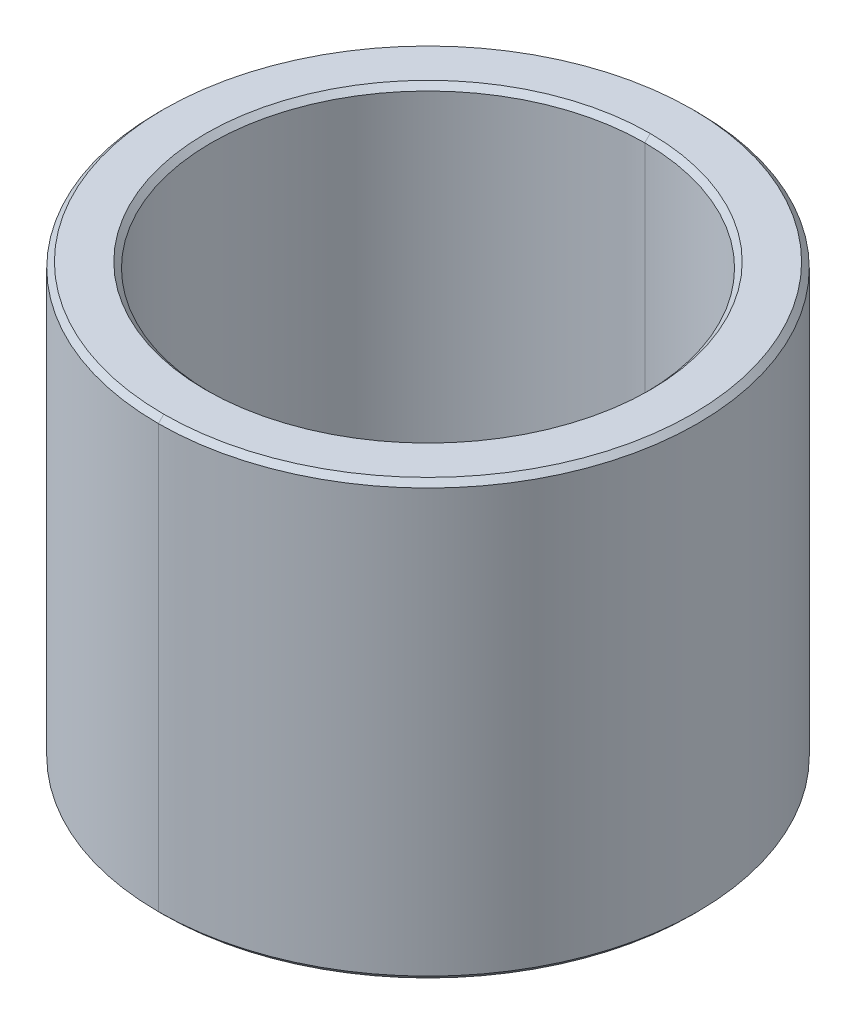
ISO-10303-21;
HEADER;
FILE_DESCRIPTION(('STEP AP214'),'2;1');
FILE_NAME('part.step','',(''),(''),'','','');
FILE_SCHEMA(('AUTOMOTIVE_DESIGN { 1 0 10303 214 1 1 1 1 }'));
ENDSEC;
DATA;
#1=APPLICATION_CONTEXT('core data for automotive mechanical design processes');
#2=APPLICATION_PROTOCOL_DEFINITION('international standard','automotive_design',2000,#1);
#3=PRODUCT_CONTEXT('',#1,'mechanical');
#4=PRODUCT('Part','Part','',(#3));
#5=PRODUCT_RELATED_PRODUCT_CATEGORY('part','',(#4));
#6=PRODUCT_DEFINITION_FORMATION('','',#4);
#7=PRODUCT_DEFINITION_CONTEXT('part definition',#1,'design');
#8=PRODUCT_DEFINITION('design','',#6,#7);
#9=PRODUCT_DEFINITION_SHAPE('','',#8);
#10=(LENGTH_UNIT() NAMED_UNIT(*) SI_UNIT(.MILLI.,.METRE.));
#11=(NAMED_UNIT(*) PLANE_ANGLE_UNIT() SI_UNIT($,.RADIAN.));
#12=(NAMED_UNIT(*) SI_UNIT($,.STERADIAN.) SOLID_ANGLE_UNIT());
#13=UNCERTAINTY_MEASURE_WITH_UNIT(LENGTH_MEASURE(1.E-05),#10,'distance_accuracy_value','');
#14=(GEOMETRIC_REPRESENTATION_CONTEXT(3) GLOBAL_UNCERTAINTY_ASSIGNED_CONTEXT((#13)) GLOBAL_UNIT_ASSIGNED_CONTEXT((#10,
#11,#12)) REPRESENTATION_CONTEXT('',''));
#15=CARTESIAN_POINT('',(0.,0.,0.));
#16=DIRECTION('',(0.,0.,1.));
#17=DIRECTION('',(1.,0.,0.));
#18=AXIS2_PLACEMENT_3D('',#15,#16,#17);
#19=CARTESIAN_POINT('',(0.,3.9,0.));
#20=DIRECTION('',(0.,1.,0.));
#21=DIRECTION('',(0.,0.,1.));
#22=AXIS2_PLACEMENT_3D('',#19,#20,#21);
#23=CONICAL_SURFACE('',#22,4.,0.785398163397448);
#24=DIRECTION('',(0.,0.707106781186548,-0.707106781186548));
#25=VECTOR('',#24,1.);
#26=CARTESIAN_POINT('',(0.,3.9,-4.));
#27=LINE('',#26,#25);
#28=CARTESIAN_POINT('',(0.,3.9,-4.));
#29=VERTEX_POINT('',#28);
#30=CARTESIAN_POINT('',(0.,4.,-4.1));
#31=VERTEX_POINT('',#30);
#32=EDGE_CURVE('E117',#29,#31,#27,.T.);
#33=ORIENTED_EDGE('',*,*,#32,.F.);
#34=CARTESIAN_POINT('',(0.,3.9,0.));
#35=DIRECTION('',(0.,1.,0.));
#36=DIRECTION('',(0.,0.,1.));
#37=AXIS2_PLACEMENT_3D('',#34,#35,#36);
#38=CIRCLE('',#37,4.);
#39=CARTESIAN_POINT('',(0.,3.9,4.));
#40=VERTEX_POINT('',#39);
#41=EDGE_CURVE('E29',#40,#29,#38,.T.);
#42=ORIENTED_EDGE('',*,*,#41,.F.);
#43=DIRECTION('',(0.,0.707106781186548,0.707106781186548));
#44=VECTOR('',#43,1.);
#45=CARTESIAN_POINT('',(0.,3.9,4.));
#46=LINE('',#45,#44);
#47=CARTESIAN_POINT('',(0.,4.,4.1));
#48=VERTEX_POINT('',#47);
#49=EDGE_CURVE('E114',#40,#48,#46,.T.);
#50=ORIENTED_EDGE('',*,*,#49,.T.);
#51=CARTESIAN_POINT('',(0.,4.,0.));
#52=DIRECTION('',(0.,-1.,0.));
#53=DIRECTION('',(0.,0.,1.));
#54=AXIS2_PLACEMENT_3D('',#51,#52,#53);
#55=CIRCLE('',#54,4.1);
#56=EDGE_CURVE('E171',#31,#48,#55,.T.);
#57=ORIENTED_EDGE('',*,*,#56,.F.);
#58=EDGE_LOOP('',(#33,#42,#50,#57));
#59=FACE_BOUND('',#58,.T.);
#60=ADVANCED_FACE('F18',(#59),#23,.F.);
#61=CARTESIAN_POINT('',(0.,-4.,0.));
#62=DIRECTION('',(0.,-1.,0.));
#63=DIRECTION('',(0.,0.,-1.));
#64=AXIS2_PLACEMENT_3D('',#61,#62,#63);
#65=CONICAL_SURFACE('',#64,4.1,0.785398163397448);
#66=DIRECTION('',(0.,-0.707106781186548,0.707106781186548));
#67=VECTOR('',#66,1.);
#68=CARTESIAN_POINT('',(0.,-4.,4.1));
#69=LINE('',#68,#67);
#70=CARTESIAN_POINT('',(0.,-3.9,4.));
#71=VERTEX_POINT('',#70);
#72=CARTESIAN_POINT('',(0.,-4.,4.1));
#73=VERTEX_POINT('',#72);
#74=EDGE_CURVE('E155',#71,#73,#69,.T.);
#75=ORIENTED_EDGE('',*,*,#74,.F.);
#76=CARTESIAN_POINT('',(0.,-3.9,0.));
#77=DIRECTION('',(0.,-1.,0.));
#78=DIRECTION('',(0.,0.,1.));
#79=AXIS2_PLACEMENT_3D('',#76,#77,#78);
#80=CIRCLE('',#79,4.);
#81=CARTESIAN_POINT('',(0.,-3.9,-4.));
#82=VERTEX_POINT('',#81);
#83=EDGE_CURVE('E10',#82,#71,#80,.T.);
#84=ORIENTED_EDGE('',*,*,#83,.F.);
#85=DIRECTION('',(0.,-0.707106781186548,-0.707106781186548));
#86=VECTOR('',#85,1.);
#87=CARTESIAN_POINT('',(0.,-4.,-4.1));
#88=LINE('',#87,#86);
#89=CARTESIAN_POINT('',(0.,-4.,-4.1));
#90=VERTEX_POINT('',#89);
#91=EDGE_CURVE('E170',#82,#90,#88,.T.);
#92=ORIENTED_EDGE('',*,*,#91,.T.);
#93=CARTESIAN_POINT('',(0.,-4.,0.));
#94=DIRECTION('',(0.,1.,0.));
#95=DIRECTION('',(0.,0.,1.));
#96=AXIS2_PLACEMENT_3D('',#93,#94,#95);
#97=CIRCLE('',#96,4.1);
#98=EDGE_CURVE('E162',#73,#90,#97,.T.);
#99=ORIENTED_EDGE('',*,*,#98,.F.);
#100=EDGE_LOOP('',(#75,#84,#92,#99));
#101=FACE_BOUND('',#100,.T.);
#102=ADVANCED_FACE('F20',(#101),#65,.F.);
#103=CARTESIAN_POINT('',(0.,4.,0.));
#104=DIRECTION('',(0.,-1.,0.));
#105=DIRECTION('',(0.,0.,-1.));
#106=AXIS2_PLACEMENT_3D('',#103,#104,#105);
#107=CONICAL_SURFACE('',#106,4.875,0.785398163397462);
#108=DIRECTION('',(0.,-0.707106781186538,0.707106781186557));
#109=VECTOR('',#108,1.);
#110=CARTESIAN_POINT('',(0.,4.,4.875));
#111=LINE('',#110,#109);
#112=CARTESIAN_POINT('',(0.,4.,4.875));
#113=VERTEX_POINT('',#112);
#114=CARTESIAN_POINT('',(0.,3.9,4.975));
#115=VERTEX_POINT('',#114);
#116=EDGE_CURVE('E180',#113,#115,#111,.T.);
#117=ORIENTED_EDGE('',*,*,#116,.F.);
#118=CARTESIAN_POINT('',(0.,4.,0.));
#119=DIRECTION('',(0.,1.,0.));
#120=DIRECTION('',(0.,0.,1.));
#121=AXIS2_PLACEMENT_3D('',#118,#119,#120);
#122=CIRCLE('',#121,4.875);
#123=CARTESIAN_POINT('',(0.,4.,-4.875));
#124=VERTEX_POINT('',#123);
#125=EDGE_CURVE('E87',#124,#113,#122,.T.);
#126=ORIENTED_EDGE('',*,*,#125,.F.);
#127=DIRECTION('',(0.,-0.707106781186538,-0.707106781186557));
#128=VECTOR('',#127,1.);
#129=CARTESIAN_POINT('',(0.,4.,-4.875));
#130=LINE('',#129,#128);
#131=CARTESIAN_POINT('',(0.,3.9,-4.975));
#132=VERTEX_POINT('',#131);
#133=EDGE_CURVE('E179',#124,#132,#130,.T.);
#134=ORIENTED_EDGE('',*,*,#133,.T.);
#135=CARTESIAN_POINT('',(0.,3.9,0.));
#136=DIRECTION('',(0.,-1.,0.));
#137=DIRECTION('',(0.,0.,1.));
#138=AXIS2_PLACEMENT_3D('',#135,#136,#137);
#139=CIRCLE('',#138,4.975);
#140=EDGE_CURVE('E159',#115,#132,#139,.T.);
#141=ORIENTED_EDGE('',*,*,#140,.F.);
#142=EDGE_LOOP('',(#117,#126,#134,#141));
#143=FACE_BOUND('',#142,.T.);
#144=ADVANCED_FACE('F281',(#143),#107,.T.);
#145=CARTESIAN_POINT('',(0.,-3.9,0.));
#146=DIRECTION('',(0.,1.,0.));
#147=DIRECTION('',(0.,0.,1.));
#148=AXIS2_PLACEMENT_3D('',#145,#146,#147);
#149=CONICAL_SURFACE('',#148,4.975,0.785398163397448);
#150=DIRECTION('',(0.,0.707106781186548,-0.707106781186548));
#151=VECTOR('',#150,1.);
#152=CARTESIAN_POINT('',(0.,-3.9,-4.975));
#153=LINE('',#152,#151);
#154=CARTESIAN_POINT('',(0.,-4.,-4.875));
#155=VERTEX_POINT('',#154);
#156=CARTESIAN_POINT('',(0.,-3.9,-4.975));
#157=VERTEX_POINT('',#156);
#158=EDGE_CURVE('E185',#155,#157,#153,.T.);
#159=ORIENTED_EDGE('',*,*,#158,.F.);
#160=CARTESIAN_POINT('',(0.,-4.,0.));
#161=DIRECTION('',(0.,-1.,0.));
#162=DIRECTION('',(0.,0.,1.));
#163=AXIS2_PLACEMENT_3D('',#160,#161,#162);
#164=CIRCLE('',#163,4.875);
#165=CARTESIAN_POINT('',(0.,-4.,4.875));
#166=VERTEX_POINT('',#165);
#167=EDGE_CURVE('E175',#166,#155,#164,.T.);
#168=ORIENTED_EDGE('',*,*,#167,.F.);
#169=DIRECTION('',(0.,0.707106781186548,0.707106781186548));
#170=VECTOR('',#169,1.);
#171=CARTESIAN_POINT('',(0.,-3.9,4.975));
#172=LINE('',#171,#170);
#173=CARTESIAN_POINT('',(0.,-3.9,4.975));
#174=VERTEX_POINT('',#173);
#175=EDGE_CURVE('E133',#166,#174,#172,.T.);
#176=ORIENTED_EDGE('',*,*,#175,.T.);
#177=CARTESIAN_POINT('',(0.,-3.9,0.));
#178=DIRECTION('',(0.,1.,0.));
#179=DIRECTION('',(0.,0.,1.));
#180=AXIS2_PLACEMENT_3D('',#177,#178,#179);
#181=CIRCLE('',#180,4.975);
#182=EDGE_CURVE('E44',#157,#174,#181,.T.);
#183=ORIENTED_EDGE('',*,*,#182,.F.);
#184=EDGE_LOOP('',(#159,#168,#176,#183));
#185=FACE_BOUND('',#184,.T.);
#186=ADVANCED_FACE('F300',(#185),#149,.T.);
#187=CARTESIAN_POINT('',(0.,4.,0.));
#188=DIRECTION('',(0.,-1.,0.));
#189=DIRECTION('',(0.,0.,-1.));
#190=AXIS2_PLACEMENT_3D('',#187,#188,#189);
#191=CYLINDRICAL_SURFACE('',#190,4.);
#192=DIRECTION('',(0.,-1.,0.));
#193=VECTOR('',#192,1.);
#194=CARTESIAN_POINT('',(0.,4.,4.));
#195=LINE('',#194,#193);
#196=EDGE_CURVE('E125',#40,#71,#195,.T.);
#197=ORIENTED_EDGE('',*,*,#196,.F.);
#198=ORIENTED_EDGE('',*,*,#41,.T.);
#199=DIRECTION('',(0.,-1.,0.));
#200=VECTOR('',#199,1.);
#201=CARTESIAN_POINT('',(0.,4.,-4.));
#202=LINE('',#201,#200);
#203=EDGE_CURVE('E132',#29,#82,#202,.T.);
#204=ORIENTED_EDGE('',*,*,#203,.T.);
#205=ORIENTED_EDGE('',*,*,#83,.T.);
#206=EDGE_LOOP('',(#197,#198,#204,#205));
#207=FACE_BOUND('',#206,.T.);
#208=ADVANCED_FACE('F126',(#207),#191,.F.);
#209=CARTESIAN_POINT('',(0.,4.,0.));
#210=DIRECTION('',(0.,-1.,0.));
#211=DIRECTION('',(0.,0.,-1.));
#212=AXIS2_PLACEMENT_3D('',#209,#210,#211);
#213=CYLINDRICAL_SURFACE('',#212,4.975);
#214=DIRECTION('',(0.,-1.,0.));
#215=VECTOR('',#214,1.);
#216=CARTESIAN_POINT('',(0.,4.,4.975));
#217=LINE('',#216,#215);
#218=EDGE_CURVE('E163',#115,#174,#217,.T.);
#219=ORIENTED_EDGE('',*,*,#218,.F.);
#220=ORIENTED_EDGE('',*,*,#140,.T.);
#221=DIRECTION('',(0.,-1.,0.));
#222=VECTOR('',#221,1.);
#223=CARTESIAN_POINT('',(0.,4.,-4.975));
#224=LINE('',#223,#222);
#225=EDGE_CURVE('E166',#132,#157,#224,.T.);
#226=ORIENTED_EDGE('',*,*,#225,.T.);
#227=ORIENTED_EDGE('',*,*,#182,.T.);
#228=EDGE_LOOP('',(#219,#220,#226,#227));
#229=FACE_BOUND('',#228,.T.);
#230=ADVANCED_FACE('F328',(#229),#213,.T.);
#231=CARTESIAN_POINT('',(0.,-4.,0.));
#232=DIRECTION('',(0.,1.,0.));
#233=DIRECTION('',(1.,0.,0.));
#234=AXIS2_PLACEMENT_3D('',#231,#232,#233);
#235=PLANE('',#234);
#236=CARTESIAN_POINT('',(0.,-4.,0.));
#237=DIRECTION('',(0.,1.,0.));
#238=DIRECTION('',(0.,0.,1.));
#239=AXIS2_PLACEMENT_3D('',#236,#237,#238);
#240=CIRCLE('',#239,4.1);
#241=EDGE_CURVE('E157',#90,#73,#240,.T.);
#242=ORIENTED_EDGE('',*,*,#241,.T.);
#243=ORIENTED_EDGE('',*,*,#98,.T.);
#244=EDGE_LOOP('',(#242,#243));
#245=FACE_BOUND('',#244,.T.);
#246=ORIENTED_EDGE('',*,*,#167,.T.);
#247=CARTESIAN_POINT('',(0.,-4.,0.));
#248=DIRECTION('',(0.,-1.,0.));
#249=DIRECTION('',(0.,0.,1.));
#250=AXIS2_PLACEMENT_3D('',#247,#248,#249);
#251=CIRCLE('',#250,4.875);
#252=EDGE_CURVE('E188',#155,#166,#251,.T.);
#253=ORIENTED_EDGE('',*,*,#252,.T.);
#254=EDGE_LOOP('',(#246,#253));
#255=FACE_BOUND('',#254,.T.);
#256=ADVANCED_FACE('F332',(#245,#255),#235,.F.);
#257=CARTESIAN_POINT('',(0.,4.,0.));
#258=DIRECTION('',(0.,1.,0.));
#259=DIRECTION('',(1.,0.,0.));
#260=AXIS2_PLACEMENT_3D('',#257,#258,#259);
#261=PLANE('',#260);
#262=CARTESIAN_POINT('',(0.,4.,0.));
#263=DIRECTION('',(0.,-1.,0.));
#264=DIRECTION('',(0.,0.,1.));
#265=AXIS2_PLACEMENT_3D('',#262,#263,#264);
#266=CIRCLE('',#265,4.1);
#267=EDGE_CURVE('E139',#48,#31,#266,.T.);
#268=ORIENTED_EDGE('',*,*,#267,.T.);
#269=ORIENTED_EDGE('',*,*,#56,.T.);
#270=EDGE_LOOP('',(#268,#269));
#271=FACE_BOUND('',#270,.T.);
#272=ORIENTED_EDGE('',*,*,#125,.T.);
#273=CARTESIAN_POINT('',(0.,4.,0.));
#274=DIRECTION('',(0.,1.,0.));
#275=DIRECTION('',(0.,0.,1.));
#276=AXIS2_PLACEMENT_3D('',#273,#274,#275);
#277=CIRCLE('',#276,4.875);
#278=EDGE_CURVE('E22',#113,#124,#277,.T.);
#279=ORIENTED_EDGE('',*,*,#278,.T.);
#280=EDGE_LOOP('',(#272,#279));
#281=FACE_BOUND('',#280,.T.);
#282=ADVANCED_FACE('F194',(#271,#281),#261,.T.);
#283=CARTESIAN_POINT('',(0.,4.,0.));
#284=DIRECTION('',(0.,-1.,0.));
#285=DIRECTION('',(0.,0.,-1.));
#286=AXIS2_PLACEMENT_3D('',#283,#284,#285);
#287=CYLINDRICAL_SURFACE('',#286,4.975);
#288=CARTESIAN_POINT('',(0.,3.9,0.));
#289=DIRECTION('',(0.,-1.,0.));
#290=DIRECTION('',(0.,0.,1.));
#291=AXIS2_PLACEMENT_3D('',#288,#289,#290);
#292=CIRCLE('',#291,4.975);
#293=EDGE_CURVE('E176',#132,#115,#292,.T.);
#294=ORIENTED_EDGE('',*,*,#293,.T.);
#295=ORIENTED_EDGE('',*,*,#218,.T.);
#296=CARTESIAN_POINT('',(0.,-3.9,0.));
#297=DIRECTION('',(0.,1.,0.));
#298=DIRECTION('',(0.,0.,1.));
#299=AXIS2_PLACEMENT_3D('',#296,#297,#298);
#300=CIRCLE('',#299,4.975);
#301=EDGE_CURVE('E182',#174,#157,#300,.T.);
#302=ORIENTED_EDGE('',*,*,#301,.T.);
#303=ORIENTED_EDGE('',*,*,#225,.F.);
#304=EDGE_LOOP('',(#294,#295,#302,#303));
#305=FACE_BOUND('',#304,.T.);
#306=ADVANCED_FACE('F319',(#305),#287,.T.);
#307=CARTESIAN_POINT('',(0.,4.,0.));
#308=DIRECTION('',(0.,-1.,0.));
#309=DIRECTION('',(0.,0.,-1.));
#310=AXIS2_PLACEMENT_3D('',#307,#308,#309);
#311=CYLINDRICAL_SURFACE('',#310,4.);
#312=CARTESIAN_POINT('',(0.,3.9,0.));
#313=DIRECTION('',(0.,1.,0.));
#314=DIRECTION('',(0.,0.,1.));
#315=AXIS2_PLACEMENT_3D('',#312,#313,#314);
#316=CIRCLE('',#315,4.);
#317=EDGE_CURVE('E137',#29,#40,#316,.T.);
#318=ORIENTED_EDGE('',*,*,#317,.T.);
#319=ORIENTED_EDGE('',*,*,#196,.T.);
#320=CARTESIAN_POINT('',(0.,-3.9,0.));
#321=DIRECTION('',(0.,-1.,0.));
#322=DIRECTION('',(0.,0.,1.));
#323=AXIS2_PLACEMENT_3D('',#320,#321,#322);
#324=CIRCLE('',#323,4.);
#325=EDGE_CURVE('E141',#71,#82,#324,.T.);
#326=ORIENTED_EDGE('',*,*,#325,.T.);
#327=ORIENTED_EDGE('',*,*,#203,.F.);
#328=EDGE_LOOP('',(#318,#319,#326,#327));
#329=FACE_BOUND('',#328,.T.);
#330=ADVANCED_FACE('F143',(#329),#311,.F.);
#331=CARTESIAN_POINT('',(0.,-3.9,0.));
#332=DIRECTION('',(0.,1.,0.));
#333=DIRECTION('',(0.,0.,1.));
#334=AXIS2_PLACEMENT_3D('',#331,#332,#333);
#335=CONICAL_SURFACE('',#334,4.975,0.785398163397448);
#336=ORIENTED_EDGE('',*,*,#252,.F.);
#337=ORIENTED_EDGE('',*,*,#158,.T.);
#338=ORIENTED_EDGE('',*,*,#301,.F.);
#339=ORIENTED_EDGE('',*,*,#175,.F.);
#340=EDGE_LOOP('',(#336,#337,#338,#339));
#341=FACE_BOUND('',#340,.T.);
#342=ADVANCED_FACE('F313',(#341),#335,.T.);
#343=CARTESIAN_POINT('',(0.,4.,0.));
#344=DIRECTION('',(0.,-1.,0.));
#345=DIRECTION('',(0.,0.,-1.));
#346=AXIS2_PLACEMENT_3D('',#343,#344,#345);
#347=CONICAL_SURFACE('',#346,4.875,0.785398163397462);
#348=ORIENTED_EDGE('',*,*,#278,.F.);
#349=ORIENTED_EDGE('',*,*,#116,.T.);
#350=ORIENTED_EDGE('',*,*,#293,.F.);
#351=ORIENTED_EDGE('',*,*,#133,.F.);
#352=EDGE_LOOP('',(#348,#349,#350,#351));
#353=FACE_BOUND('',#352,.T.);
#354=ADVANCED_FACE('F309',(#353),#347,.T.);
#355=CARTESIAN_POINT('',(0.,-4.,0.));
#356=DIRECTION('',(0.,-1.,0.));
#357=DIRECTION('',(0.,0.,-1.));
#358=AXIS2_PLACEMENT_3D('',#355,#356,#357);
#359=CONICAL_SURFACE('',#358,4.1,0.785398163397448);
#360=ORIENTED_EDGE('',*,*,#325,.F.);
#361=ORIENTED_EDGE('',*,*,#74,.T.);
#362=ORIENTED_EDGE('',*,*,#241,.F.);
#363=ORIENTED_EDGE('',*,*,#91,.F.);
#364=EDGE_LOOP('',(#360,#361,#362,#363));
#365=FACE_BOUND('',#364,.T.);
#366=ADVANCED_FACE('F295',(#365),#359,.F.);
#367=CARTESIAN_POINT('',(0.,3.9,0.));
#368=DIRECTION('',(0.,1.,0.));
#369=DIRECTION('',(0.,0.,1.));
#370=AXIS2_PLACEMENT_3D('',#367,#368,#369);
#371=CONICAL_SURFACE('',#370,4.,0.785398163397448);
#372=ORIENTED_EDGE('',*,*,#317,.F.);
#373=ORIENTED_EDGE('',*,*,#32,.T.);
#374=ORIENTED_EDGE('',*,*,#267,.F.);
#375=ORIENTED_EDGE('',*,*,#49,.F.);
#376=EDGE_LOOP('',(#372,#373,#374,#375));
#377=FACE_BOUND('',#376,.T.);
#378=ADVANCED_FACE('F136',(#377),#371,.F.);
#379=CLOSED_SHELL('',(#60,#102,#144,#186,#208,#230,#256,#282,#306,#330,#342,#354,#366,#378));
#380=MANIFOLD_SOLID_BREP('B1',#379);
#381=ADVANCED_BREP_SHAPE_REPRESENTATION('',(#18,#380),#14);
#382=SHAPE_DEFINITION_REPRESENTATION(#9,#381);
ENDSEC;
END-ISO-10303-21;
